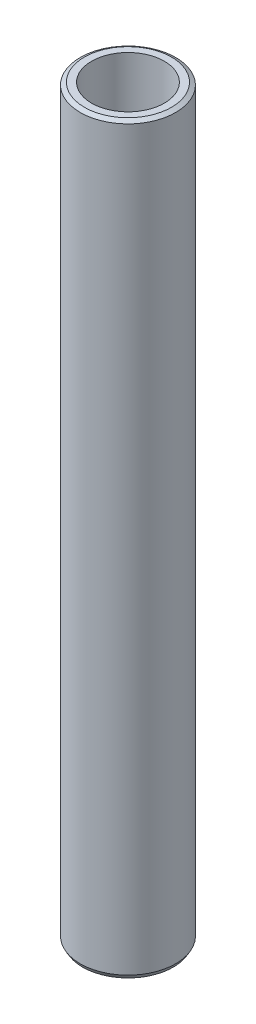
ISO-10303-21;
HEADER;
FILE_DESCRIPTION(('STEP AP214'),'2;1');
FILE_NAME('part.step','',(''),(''),'','','');
FILE_SCHEMA(('AUTOMOTIVE_DESIGN { 1 0 10303 214 1 1 1 1 }'));
ENDSEC;
DATA;
#1=APPLICATION_CONTEXT('core data for automotive mechanical design processes');
#2=APPLICATION_PROTOCOL_DEFINITION('international standard','automotive_design',2000,#1);
#3=PRODUCT_CONTEXT('',#1,'mechanical');
#4=PRODUCT('Part','Part','',(#3));
#5=PRODUCT_RELATED_PRODUCT_CATEGORY('part','',(#4));
#6=PRODUCT_DEFINITION_FORMATION('','',#4);
#7=PRODUCT_DEFINITION_CONTEXT('part definition',#1,'design');
#8=PRODUCT_DEFINITION('design','',#6,#7);
#9=PRODUCT_DEFINITION_SHAPE('','',#8);
#10=(LENGTH_UNIT() NAMED_UNIT(*) SI_UNIT(.MILLI.,.METRE.));
#11=(NAMED_UNIT(*) PLANE_ANGLE_UNIT() SI_UNIT($,.RADIAN.));
#12=(NAMED_UNIT(*) SI_UNIT($,.STERADIAN.) SOLID_ANGLE_UNIT());
#13=UNCERTAINTY_MEASURE_WITH_UNIT(LENGTH_MEASURE(1.E-05),#10,'distance_accuracy_value','');
#14=(GEOMETRIC_REPRESENTATION_CONTEXT(3) GLOBAL_UNCERTAINTY_ASSIGNED_CONTEXT((#13)) GLOBAL_UNIT_ASSIGNED_CONTEXT((#10,
#11,#12)) REPRESENTATION_CONTEXT('',''));
#15=CARTESIAN_POINT('',(0.,0.,0.));
#16=DIRECTION('',(0.,0.,1.));
#17=DIRECTION('',(1.,0.,0.));
#18=AXIS2_PLACEMENT_3D('',#15,#16,#17);
#19=CARTESIAN_POINT('',(0.,467.641612657365,0.));
#20=DIRECTION('',(0.,-1.,0.));
#21=DIRECTION('',(0.,0.,-1.));
#22=AXIS2_PLACEMENT_3D('',#19,#20,#21);
#23=CYLINDRICAL_SURFACE('',#22,30.);
#24=CARTESIAN_POINT('',(0.,466.128833370957,0.));
#25=DIRECTION('',(0.,1.,0.));
#26=DIRECTION('',(0.,0.,1.));
#27=AXIS2_PLACEMENT_3D('',#24,#25,#26);
#28=CIRCLE('',#27,30.);
#29=CARTESIAN_POINT('',(0.,466.128833370957,30.));
#30=VERTEX_POINT('',#29);
#31=EDGE_CURVE('E50',#30,#30,#28,.F.);
#32=ORIENTED_EDGE('',*,*,#31,.T.);
#33=EDGE_LOOP('',(#32));
#34=FACE_BOUND('',#33,.T.);
#35=CARTESIAN_POINT('',(0.,2.62021058469597,0.));
#36=DIRECTION('',(0.,1.,0.));
#37=DIRECTION('',(0.,0.,1.));
#38=AXIS2_PLACEMENT_3D('',#35,#36,#37);
#39=CIRCLE('',#38,30.);
#40=CARTESIAN_POINT('',(0.,2.62021058469597,30.));
#41=VERTEX_POINT('',#40);
#42=EDGE_CURVE('E51',#41,#41,#39,.T.);
#43=ORIENTED_EDGE('',*,*,#42,.T.);
#44=EDGE_LOOP('',(#43));
#45=FACE_BOUND('',#44,.T.);
#46=ADVANCED_FACE('F39',(#34,#45),#23,.T.);
#47=CARTESIAN_POINT('',(0.,467.641612657365,0.));
#48=DIRECTION('',(0.,1.,0.));
#49=DIRECTION('',(0.,0.,1.));
#50=AXIS2_PLACEMENT_3D('',#47,#48,#49);
#51=PLANE('',#50);
#52=CARTESIAN_POINT('',(0.,467.641612657365,0.));
#53=DIRECTION('',(0.,1.,0.));
#54=DIRECTION('',(0.,0.,1.));
#55=AXIS2_PLACEMENT_3D('',#52,#53,#54);
#56=CIRCLE('',#55,27.3797894153039);
#57=CARTESIAN_POINT('',(0.,467.641612657365,27.3797894153039));
#58=VERTEX_POINT('',#57);
#59=EDGE_CURVE('E54',#58,#58,#56,.T.);
#60=ORIENTED_EDGE('',*,*,#59,.T.);
#61=EDGE_LOOP('',(#60));
#62=FACE_BOUND('',#61,.T.);
#63=CARTESIAN_POINT('',(0.,467.641612657365,0.));
#64=DIRECTION('',(0.,1.,0.));
#65=DIRECTION('',(0.,0.,1.));
#66=AXIS2_PLACEMENT_3D('',#63,#64,#65);
#67=CIRCLE('',#66,22.8713313426946);
#68=CARTESIAN_POINT('',(0.,467.641612657365,22.8713313426946));
#69=VERTEX_POINT('',#68);
#70=EDGE_CURVE('E58',#69,#69,#67,.T.);
#71=ORIENTED_EDGE('',*,*,#70,.F.);
#72=EDGE_LOOP('',(#71));
#73=FACE_BOUND('',#72,.T.);
#74=ADVANCED_FACE('F69',(#62,#73),#51,.T.);
#75=CARTESIAN_POINT('',(0.,0.,0.));
#76=DIRECTION('',(0.,1.,0.));
#77=DIRECTION('',(0.,0.,1.));
#78=AXIS2_PLACEMENT_3D('',#75,#76,#77);
#79=PLANE('',#78);
#80=CARTESIAN_POINT('',(0.,0.,0.));
#81=DIRECTION('',(0.,1.,0.));
#82=DIRECTION('',(0.,0.,1.));
#83=AXIS2_PLACEMENT_3D('',#80,#81,#82);
#84=CIRCLE('',#83,28.4872207135922);
#85=CARTESIAN_POINT('',(0.,0.,28.4872207135922));
#86=VERTEX_POINT('',#85);
#87=EDGE_CURVE('E10',#86,#86,#84,.F.);
#88=ORIENTED_EDGE('',*,*,#87,.T.);
#89=EDGE_LOOP('',(#88));
#90=FACE_BOUND('',#89,.T.);
#91=CARTESIAN_POINT('',(0.,0.,0.));
#92=DIRECTION('',(0.,1.,0.));
#93=DIRECTION('',(0.,0.,1.));
#94=AXIS2_PLACEMENT_3D('',#91,#92,#93);
#95=CIRCLE('',#94,22.8713313426946);
#96=CARTESIAN_POINT('',(0.,0.,22.8713313426946));
#97=VERTEX_POINT('',#96);
#98=EDGE_CURVE('E63',#97,#97,#95,.T.);
#99=ORIENTED_EDGE('',*,*,#98,.T.);
#100=EDGE_LOOP('',(#99));
#101=FACE_BOUND('',#100,.T.);
#102=ADVANCED_FACE('F75',(#90,#101),#79,.F.);
#103=CARTESIAN_POINT('',(0.,467.641612657365,0.));
#104=DIRECTION('',(0.,-1.,0.));
#105=DIRECTION('',(0.,0.,-1.));
#106=AXIS2_PLACEMENT_3D('',#103,#104,#105);
#107=CYLINDRICAL_SURFACE('',#106,22.8713313426946);
#108=ORIENTED_EDGE('',*,*,#70,.T.);
#109=EDGE_LOOP('',(#108));
#110=FACE_BOUND('',#109,.T.);
#111=ORIENTED_EDGE('',*,*,#98,.F.);
#112=EDGE_LOOP('',(#111));
#113=FACE_BOUND('',#112,.T.);
#114=ADVANCED_FACE('F70',(#110,#113),#107,.F.);
#115=CARTESIAN_POINT('',(0.,467.641612657365,0.));
#116=DIRECTION('',(0.,-1.,0.));
#117=DIRECTION('',(0.,0.,-1.));
#118=AXIS2_PLACEMENT_3D('',#115,#116,#117);
#119=CONICAL_SURFACE('',#118,27.3797894153039,1.04719755119659);
#120=ORIENTED_EDGE('',*,*,#31,.F.);
#121=EDGE_LOOP('',(#120));
#122=FACE_BOUND('',#121,.T.);
#123=ORIENTED_EDGE('',*,*,#59,.F.);
#124=EDGE_LOOP('',(#123));
#125=FACE_BOUND('',#124,.T.);
#126=ADVANCED_FACE('F81',(#122,#125),#119,.T.);
#127=CARTESIAN_POINT('',(0.,2.62021058469597,0.));
#128=DIRECTION('',(0.,1.,0.));
#129=DIRECTION('',(0.,0.,1.));
#130=AXIS2_PLACEMENT_3D('',#127,#128,#129);
#131=CONICAL_SURFACE('',#130,30.,0.523598775598306);
#132=ORIENTED_EDGE('',*,*,#87,.F.);
#133=EDGE_LOOP('',(#132));
#134=FACE_BOUND('',#133,.T.);
#135=ORIENTED_EDGE('',*,*,#42,.F.);
#136=EDGE_LOOP('',(#135));
#137=FACE_BOUND('',#136,.T.);
#138=ADVANCED_FACE('F45',(#134,#137),#131,.T.);
#139=CLOSED_SHELL('',(#46,#74,#102,#114,#126,#138));
#140=MANIFOLD_SOLID_BREP('B2',#139);
#141=ADVANCED_BREP_SHAPE_REPRESENTATION('',(#18,#140),#14);
#142=SHAPE_DEFINITION_REPRESENTATION(#9,#141);
ENDSEC;
END-ISO-10303-21;
